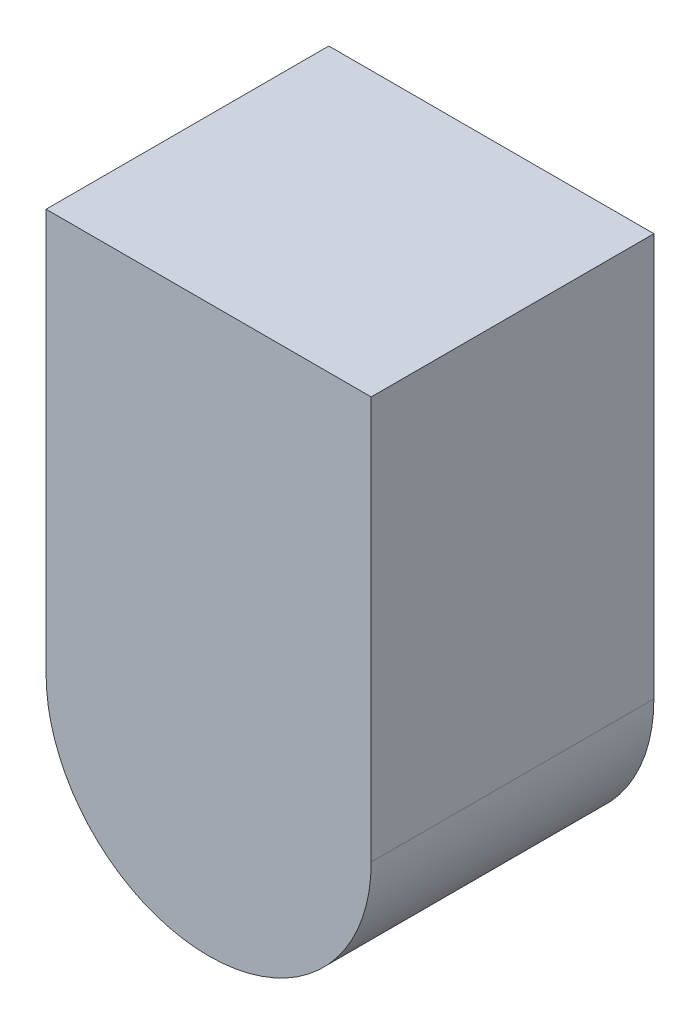
ISO-10303-21;
HEADER;
FILE_DESCRIPTION(('STEP AP214'),'2;1');
FILE_NAME('part.step','',(''),(''),'','','');
FILE_SCHEMA(('AUTOMOTIVE_DESIGN { 1 0 10303 214 1 1 1 1 }'));
ENDSEC;
DATA;
#1=APPLICATION_CONTEXT('core data for automotive mechanical design processes');
#2=APPLICATION_PROTOCOL_DEFINITION('international standard','automotive_design',2000,#1);
#3=PRODUCT_CONTEXT('',#1,'mechanical');
#4=PRODUCT('Part','Part','',(#3));
#5=PRODUCT_RELATED_PRODUCT_CATEGORY('part','',(#4));
#6=PRODUCT_DEFINITION_FORMATION('','',#4);
#7=PRODUCT_DEFINITION_CONTEXT('part definition',#1,'design');
#8=PRODUCT_DEFINITION('design','',#6,#7);
#9=PRODUCT_DEFINITION_SHAPE('','',#8);
#10=(LENGTH_UNIT() NAMED_UNIT(*) SI_UNIT(.MILLI.,.METRE.));
#11=(NAMED_UNIT(*) PLANE_ANGLE_UNIT() SI_UNIT($,.RADIAN.));
#12=(NAMED_UNIT(*) SI_UNIT($,.STERADIAN.) SOLID_ANGLE_UNIT());
#13=UNCERTAINTY_MEASURE_WITH_UNIT(LENGTH_MEASURE(1.E-05),#10,'distance_accuracy_value','');
#14=(GEOMETRIC_REPRESENTATION_CONTEXT(3) GLOBAL_UNCERTAINTY_ASSIGNED_CONTEXT((#13)) GLOBAL_UNIT_ASSIGNED_CONTEXT((#10,
#11,#12)) REPRESENTATION_CONTEXT('',''));
#15=CARTESIAN_POINT('',(0.,0.,0.));
#16=DIRECTION('',(0.,0.,1.));
#17=DIRECTION('',(1.,0.,0.));
#18=AXIS2_PLACEMENT_3D('',#15,#16,#17);
#19=CARTESIAN_POINT('',(2.25,2.8335265642716,0.));
#20=DIRECTION('',(0.,0.,1.));
#21=DIRECTION('',(0.,-1.,0.));
#22=AXIS2_PLACEMENT_3D('',#19,#20,#21);
#23=PLANE('',#22);
#24=DIRECTION('',(-1.,0.,0.));
#25=VECTOR('',#24,1.);
#26=CARTESIAN_POINT('',(2.365,3.,0.));
#27=LINE('',#26,#25);
#28=CARTESIAN_POINT('',(2.365,3.,0.));
#29=VERTEX_POINT('',#28);
#30=CARTESIAN_POINT('',(2.135,3.,0.));
#31=VERTEX_POINT('',#30);
#32=EDGE_CURVE('E11',#29,#31,#27,.T.);
#33=ORIENTED_EDGE('',*,*,#32,.F.);
#34=DIRECTION('',(0.,1.,0.));
#35=VECTOR('',#34,1.);
#36=CARTESIAN_POINT('',(2.365,2.715,0.));
#37=LINE('',#36,#35);
#38=CARTESIAN_POINT('',(2.365,2.715,0.));
#39=VERTEX_POINT('',#38);
#40=EDGE_CURVE('E24',#39,#29,#37,.T.);
#41=ORIENTED_EDGE('',*,*,#40,.F.);
#42=CARTESIAN_POINT('',(2.25,2.715,0.));
#43=DIRECTION('',(0.,0.,1.));
#44=DIRECTION('',(-1.,0.,0.));
#45=AXIS2_PLACEMENT_3D('',#42,#43,#44);
#46=CIRCLE('',#45,0.115);
#47=CARTESIAN_POINT('',(2.135,2.715,0.));
#48=VERTEX_POINT('',#47);
#49=EDGE_CURVE('E85',#48,#39,#46,.T.);
#50=ORIENTED_EDGE('',*,*,#49,.F.);
#51=DIRECTION('',(0.,-1.,0.));
#52=VECTOR('',#51,1.);
#53=CARTESIAN_POINT('',(2.135,3.,0.));
#54=LINE('',#53,#52);
#55=EDGE_CURVE('E82',#31,#48,#54,.T.);
#56=ORIENTED_EDGE('',*,*,#55,.F.);
#57=EDGE_LOOP('',(#33,#41,#50,#56));
#58=FACE_BOUND('',#57,.T.);
#59=ADVANCED_FACE('F17',(#58),#23,.F.);
#60=CARTESIAN_POINT('',(2.135,3.,0.));
#61=DIRECTION('',(-1.,0.,0.));
#62=DIRECTION('',(0.,-1.,0.));
#63=AXIS2_PLACEMENT_3D('',#60,#61,#62);
#64=PLANE('',#63);
#65=ORIENTED_EDGE('',*,*,#55,.T.);
#66=DIRECTION('',(0.,0.,1.));
#67=VECTOR('',#66,1.);
#68=CARTESIAN_POINT('',(2.135,2.715,0.));
#69=LINE('',#68,#67);
#70=CARTESIAN_POINT('',(2.135,2.715,0.2));
#71=VERTEX_POINT('',#70);
#72=EDGE_CURVE('E80',#48,#71,#69,.T.);
#73=ORIENTED_EDGE('',*,*,#72,.T.);
#74=DIRECTION('',(0.,-1.,0.));
#75=VECTOR('',#74,1.);
#76=CARTESIAN_POINT('',(2.135,3.,0.2));
#77=LINE('',#76,#75);
#78=CARTESIAN_POINT('',(2.135,3.,0.2));
#79=VERTEX_POINT('',#78);
#80=EDGE_CURVE('E78',#79,#71,#77,.T.);
#81=ORIENTED_EDGE('',*,*,#80,.F.);
#82=DIRECTION('',(0.,0.,-1.));
#83=VECTOR('',#82,1.);
#84=CARTESIAN_POINT('',(2.135,3.,0.));
#85=LINE('',#84,#83);
#86=EDGE_CURVE('E71',#79,#31,#85,.T.);
#87=ORIENTED_EDGE('',*,*,#86,.T.);
#88=EDGE_LOOP('',(#65,#73,#81,#87));
#89=FACE_BOUND('',#88,.T.);
#90=ADVANCED_FACE('F91',(#89),#64,.T.);
#91=CARTESIAN_POINT('',(2.25,2.715,0.));
#92=DIRECTION('',(0.,0.,1.));
#93=DIRECTION('',(-1.,0.,0.));
#94=AXIS2_PLACEMENT_3D('',#91,#92,#93);
#95=CYLINDRICAL_SURFACE('',#94,0.115);
#96=ORIENTED_EDGE('',*,*,#49,.T.);
#97=DIRECTION('',(0.,0.,1.));
#98=VECTOR('',#97,1.);
#99=CARTESIAN_POINT('',(2.365,2.715,0.));
#100=LINE('',#99,#98);
#101=CARTESIAN_POINT('',(2.365,2.715,0.2));
#102=VERTEX_POINT('',#101);
#103=EDGE_CURVE('E75',#39,#102,#100,.T.);
#104=ORIENTED_EDGE('',*,*,#103,.T.);
#105=CARTESIAN_POINT('',(2.25,2.715,0.2));
#106=DIRECTION('',(0.,0.,1.));
#107=DIRECTION('',(-1.,0.,0.));
#108=AXIS2_PLACEMENT_3D('',#105,#106,#107);
#109=CIRCLE('',#108,0.115);
#110=EDGE_CURVE('E59',#71,#102,#109,.T.);
#111=ORIENTED_EDGE('',*,*,#110,.F.);
#112=ORIENTED_EDGE('',*,*,#72,.F.);
#113=EDGE_LOOP('',(#96,#104,#111,#112));
#114=FACE_BOUND('',#113,.T.);
#115=ADVANCED_FACE('F89',(#114),#95,.T.);
#116=CARTESIAN_POINT('',(2.365,2.715,0.));
#117=DIRECTION('',(1.,0.,0.));
#118=DIRECTION('',(0.,1.,0.));
#119=AXIS2_PLACEMENT_3D('',#116,#117,#118);
#120=PLANE('',#119);
#121=ORIENTED_EDGE('',*,*,#40,.T.);
#122=DIRECTION('',(0.,0.,1.));
#123=VECTOR('',#122,1.);
#124=CARTESIAN_POINT('',(2.365,3.,0.));
#125=LINE('',#124,#123);
#126=CARTESIAN_POINT('',(2.365,3.,0.2));
#127=VERTEX_POINT('',#126);
#128=EDGE_CURVE('E53',#29,#127,#125,.T.);
#129=ORIENTED_EDGE('',*,*,#128,.T.);
#130=DIRECTION('',(0.,1.,0.));
#131=VECTOR('',#130,1.);
#132=CARTESIAN_POINT('',(2.365,2.715,0.2));
#133=LINE('',#132,#131);
#134=EDGE_CURVE('E57',#102,#127,#133,.T.);
#135=ORIENTED_EDGE('',*,*,#134,.F.);
#136=ORIENTED_EDGE('',*,*,#103,.F.);
#137=EDGE_LOOP('',(#121,#129,#135,#136));
#138=FACE_BOUND('',#137,.T.);
#139=ADVANCED_FACE('F55',(#138),#120,.T.);
#140=CARTESIAN_POINT('',(3.,3.,0.));
#141=DIRECTION('',(0.,1.,0.));
#142=DIRECTION('',(-1.,0.,0.));
#143=AXIS2_PLACEMENT_3D('',#140,#141,#142);
#144=PLANE('',#143);
#145=ORIENTED_EDGE('',*,*,#86,.F.);
#146=DIRECTION('',(-1.,0.,0.));
#147=VECTOR('',#146,1.);
#148=CARTESIAN_POINT('',(2.625,3.,0.2));
#149=LINE('',#148,#147);
#150=EDGE_CURVE('E66',#127,#79,#149,.T.);
#151=ORIENTED_EDGE('',*,*,#150,.F.);
#152=ORIENTED_EDGE('',*,*,#128,.F.);
#153=ORIENTED_EDGE('',*,*,#32,.T.);
#154=EDGE_LOOP('',(#145,#151,#152,#153));
#155=FACE_BOUND('',#154,.T.);
#156=ADVANCED_FACE('F69',(#155),#144,.T.);
#157=CARTESIAN_POINT('',(2.25,2.8335240809167,0.2));
#158=DIRECTION('',(0.,0.,1.));
#159=DIRECTION('',(1.,0.,0.));
#160=AXIS2_PLACEMENT_3D('',#157,#158,#159);
#161=PLANE('',#160);
#162=ORIENTED_EDGE('',*,*,#134,.T.);
#163=ORIENTED_EDGE('',*,*,#150,.T.);
#164=ORIENTED_EDGE('',*,*,#80,.T.);
#165=ORIENTED_EDGE('',*,*,#110,.T.);
#166=EDGE_LOOP('',(#162,#163,#164,#165));
#167=FACE_BOUND('',#166,.T.);
#168=ADVANCED_FACE('F64',(#167),#161,.T.);
#169=CLOSED_SHELL('',(#59,#90,#115,#139,#156,#168));
#170=MANIFOLD_SOLID_BREP('B1',#169);
#171=ADVANCED_BREP_SHAPE_REPRESENTATION('',(#18,#170),#14);
#172=SHAPE_DEFINITION_REPRESENTATION(#9,#171);
ENDSEC;
END-ISO-10303-21;
